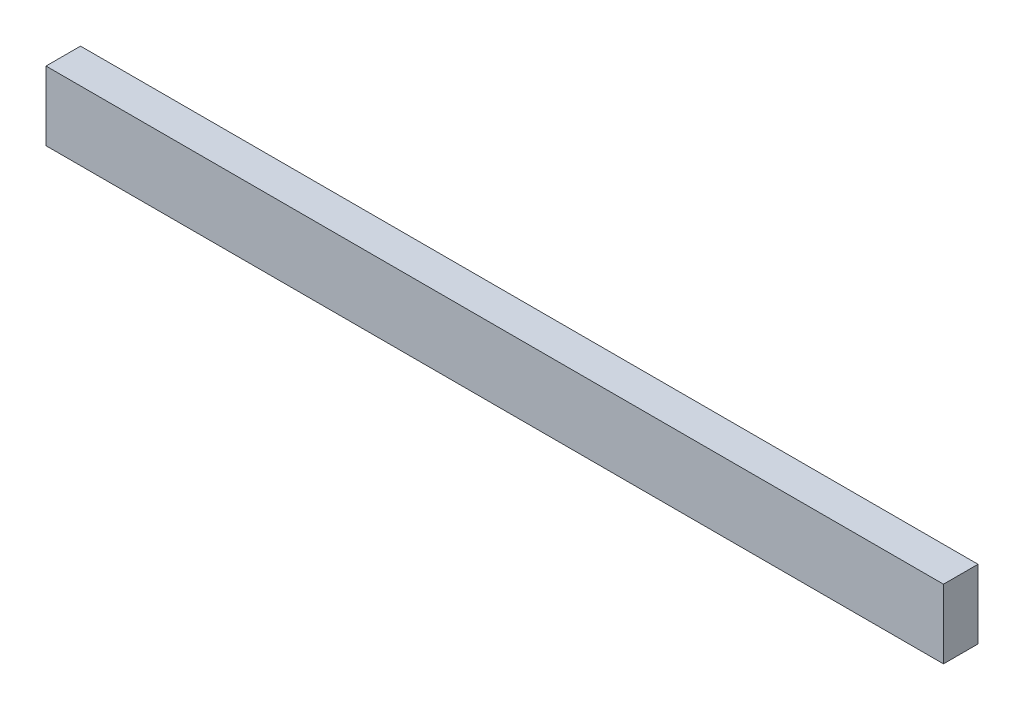
ISO-10303-21;
HEADER;
FILE_DESCRIPTION(('STEP AP214'),'2;1');
FILE_NAME('part.step','',(''),(''),'','','');
FILE_SCHEMA(('AUTOMOTIVE_DESIGN { 1 0 10303 214 1 1 1 1 }'));
ENDSEC;
DATA;
#1=APPLICATION_CONTEXT('core data for automotive mechanical design processes');
#2=APPLICATION_PROTOCOL_DEFINITION('international standard','automotive_design',2000,#1);
#3=PRODUCT_CONTEXT('',#1,'mechanical');
#4=PRODUCT('Part','Part','',(#3));
#5=PRODUCT_RELATED_PRODUCT_CATEGORY('part','',(#4));
#6=PRODUCT_DEFINITION_FORMATION('','',#4);
#7=PRODUCT_DEFINITION_CONTEXT('part definition',#1,'design');
#8=PRODUCT_DEFINITION('design','',#6,#7);
#9=PRODUCT_DEFINITION_SHAPE('','',#8);
#10=(LENGTH_UNIT() NAMED_UNIT(*) SI_UNIT(.MILLI.,.METRE.));
#11=(NAMED_UNIT(*) PLANE_ANGLE_UNIT() SI_UNIT($,.RADIAN.));
#12=(NAMED_UNIT(*) SI_UNIT($,.STERADIAN.) SOLID_ANGLE_UNIT());
#13=UNCERTAINTY_MEASURE_WITH_UNIT(LENGTH_MEASURE(1.E-05),#10,'distance_accuracy_value','');
#14=(GEOMETRIC_REPRESENTATION_CONTEXT(3) GLOBAL_UNCERTAINTY_ASSIGNED_CONTEXT((#13)) GLOBAL_UNIT_ASSIGNED_CONTEXT((#10,
#11,#12)) REPRESENTATION_CONTEXT('',''));
#15=CARTESIAN_POINT('',(0.,0.,0.));
#16=DIRECTION('',(0.,0.,1.));
#17=DIRECTION('',(1.,0.,0.));
#18=AXIS2_PLACEMENT_3D('',#15,#16,#17);
#19=CARTESIAN_POINT('',(130.,-10.,-10.));
#20=DIRECTION('',(1.,0.,0.));
#21=DIRECTION('',(0.,0.,-1.));
#22=AXIS2_PLACEMENT_3D('',#19,#20,#21);
#23=PLANE('',#22);
#24=DIRECTION('',(0.,1.,0.));
#25=VECTOR('',#24,1.);
#26=CARTESIAN_POINT('',(130.,-10.,0.));
#27=LINE('',#26,#25);
#28=CARTESIAN_POINT('',(130.,-10.,0.));
#29=VERTEX_POINT('',#28);
#30=CARTESIAN_POINT('',(130.,10.,0.));
#31=VERTEX_POINT('',#30);
#32=EDGE_CURVE('E97',#29,#31,#27,.T.);
#33=ORIENTED_EDGE('',*,*,#32,.F.);
#34=DIRECTION('',(0.,0.,1.));
#35=VECTOR('',#34,1.);
#36=CARTESIAN_POINT('',(130.,-10.,-10.));
#37=LINE('',#36,#35);
#38=CARTESIAN_POINT('',(130.,-10.,-10.));
#39=VERTEX_POINT('',#38);
#40=EDGE_CURVE('E11',#39,#29,#37,.T.);
#41=ORIENTED_EDGE('',*,*,#40,.F.);
#42=DIRECTION('',(0.,1.,0.));
#43=VECTOR('',#42,1.);
#44=CARTESIAN_POINT('',(130.,-10.,-10.));
#45=LINE('',#44,#43);
#46=CARTESIAN_POINT('',(130.,10.,-10.));
#47=VERTEX_POINT('',#46);
#48=EDGE_CURVE('E91',#39,#47,#45,.T.);
#49=ORIENTED_EDGE('',*,*,#48,.T.);
#50=DIRECTION('',(0.,0.,1.));
#51=VECTOR('',#50,1.);
#52=CARTESIAN_POINT('',(130.,10.,-10.));
#53=LINE('',#52,#51);
#54=EDGE_CURVE('E36',#47,#31,#53,.T.);
#55=ORIENTED_EDGE('',*,*,#54,.T.);
#56=EDGE_LOOP('',(#33,#41,#49,#55));
#57=FACE_BOUND('',#56,.T.);
#58=ADVANCED_FACE('F33',(#57),#23,.T.);
#59=CARTESIAN_POINT('',(-130.,-10.,-10.));
#60=DIRECTION('',(0.,-1.,0.));
#61=DIRECTION('',(0.,0.,-1.));
#62=AXIS2_PLACEMENT_3D('',#59,#60,#61);
#63=PLANE('',#62);
#64=DIRECTION('',(1.,0.,0.));
#65=VECTOR('',#64,1.);
#66=CARTESIAN_POINT('',(-130.,-10.,0.));
#67=LINE('',#66,#65);
#68=CARTESIAN_POINT('',(-130.,-10.,0.));
#69=VERTEX_POINT('',#68);
#70=EDGE_CURVE('E93',#69,#29,#67,.T.);
#71=ORIENTED_EDGE('',*,*,#70,.F.);
#72=DIRECTION('',(0.,0.,1.));
#73=VECTOR('',#72,1.);
#74=CARTESIAN_POINT('',(-130.,-10.,-10.));
#75=LINE('',#74,#73);
#76=CARTESIAN_POINT('',(-130.,-10.,-10.));
#77=VERTEX_POINT('',#76);
#78=EDGE_CURVE('E42',#77,#69,#75,.T.);
#79=ORIENTED_EDGE('',*,*,#78,.F.);
#80=DIRECTION('',(1.,0.,0.));
#81=VECTOR('',#80,1.);
#82=CARTESIAN_POINT('',(-130.,-10.,-10.));
#83=LINE('',#82,#81);
#84=EDGE_CURVE('E88',#77,#39,#83,.T.);
#85=ORIENTED_EDGE('',*,*,#84,.T.);
#86=ORIENTED_EDGE('',*,*,#40,.T.);
#87=EDGE_LOOP('',(#71,#79,#85,#86));
#88=FACE_BOUND('',#87,.T.);
#89=ADVANCED_FACE('F107',(#88),#63,.T.);
#90=CARTESIAN_POINT('',(-130.,-10.,-10.));
#91=DIRECTION('',(-1.,0.,0.));
#92=DIRECTION('',(0.,0.,1.));
#93=AXIS2_PLACEMENT_3D('',#90,#91,#92);
#94=PLANE('',#93);
#95=DIRECTION('',(0.,-1.,0.));
#96=VECTOR('',#95,1.);
#97=CARTESIAN_POINT('',(-130.,-10.,0.));
#98=LINE('',#97,#96);
#99=CARTESIAN_POINT('',(-130.,10.,0.));
#100=VERTEX_POINT('',#99);
#101=EDGE_CURVE('E83',#100,#69,#98,.T.);
#102=ORIENTED_EDGE('',*,*,#101,.F.);
#103=DIRECTION('',(0.,0.,1.));
#104=VECTOR('',#103,1.);
#105=CARTESIAN_POINT('',(-130.,10.,-10.));
#106=LINE('',#105,#104);
#107=CARTESIAN_POINT('',(-130.,10.,-10.));
#108=VERTEX_POINT('',#107);
#109=EDGE_CURVE('E78',#108,#100,#106,.T.);
#110=ORIENTED_EDGE('',*,*,#109,.F.);
#111=DIRECTION('',(0.,-1.,0.));
#112=VECTOR('',#111,1.);
#113=CARTESIAN_POINT('',(-130.,-10.,-10.));
#114=LINE('',#113,#112);
#115=EDGE_CURVE('E81',#108,#77,#114,.T.);
#116=ORIENTED_EDGE('',*,*,#115,.T.);
#117=ORIENTED_EDGE('',*,*,#78,.T.);
#118=EDGE_LOOP('',(#102,#110,#116,#117));
#119=FACE_BOUND('',#118,.T.);
#120=ADVANCED_FACE('F80',(#119),#94,.T.);
#121=CARTESIAN_POINT('',(-130.,10.,-10.));
#122=DIRECTION('',(0.,1.,0.));
#123=DIRECTION('',(0.,0.,1.));
#124=AXIS2_PLACEMENT_3D('',#121,#122,#123);
#125=PLANE('',#124);
#126=DIRECTION('',(-1.,0.,0.));
#127=VECTOR('',#126,1.);
#128=CARTESIAN_POINT('',(-130.,10.,0.));
#129=LINE('',#128,#127);
#130=EDGE_CURVE('E100',#31,#100,#129,.T.);
#131=ORIENTED_EDGE('',*,*,#130,.F.);
#132=ORIENTED_EDGE('',*,*,#54,.F.);
#133=DIRECTION('',(-1.,0.,0.));
#134=VECTOR('',#133,1.);
#135=CARTESIAN_POINT('',(-130.,10.,-10.));
#136=LINE('',#135,#134);
#137=EDGE_CURVE('E87',#47,#108,#136,.T.);
#138=ORIENTED_EDGE('',*,*,#137,.T.);
#139=ORIENTED_EDGE('',*,*,#109,.T.);
#140=EDGE_LOOP('',(#131,#132,#138,#139));
#141=FACE_BOUND('',#140,.T.);
#142=ADVANCED_FACE('F90',(#141),#125,.T.);
#143=CARTESIAN_POINT('',(0.,0.,-10.));
#144=DIRECTION('',(0.,0.,-1.));
#145=DIRECTION('',(-1.,0.,0.));
#146=AXIS2_PLACEMENT_3D('',#143,#144,#145);
#147=PLANE('',#146);
#148=ORIENTED_EDGE('',*,*,#48,.F.);
#149=ORIENTED_EDGE('',*,*,#84,.F.);
#150=ORIENTED_EDGE('',*,*,#115,.F.);
#151=ORIENTED_EDGE('',*,*,#137,.F.);
#152=EDGE_LOOP('',(#148,#149,#150,#151));
#153=FACE_BOUND('',#152,.T.);
#154=ADVANCED_FACE('F86',(#153),#147,.T.);
#155=CARTESIAN_POINT('',(0.,0.,0.));
#156=DIRECTION('',(0.,0.,-1.));
#157=DIRECTION('',(-1.,0.,0.));
#158=AXIS2_PLACEMENT_3D('',#155,#156,#157);
#159=PLANE('',#158);
#160=ORIENTED_EDGE('',*,*,#32,.T.);
#161=ORIENTED_EDGE('',*,*,#130,.T.);
#162=ORIENTED_EDGE('',*,*,#101,.T.);
#163=ORIENTED_EDGE('',*,*,#70,.T.);
#164=EDGE_LOOP('',(#160,#161,#162,#163));
#165=FACE_BOUND('',#164,.T.);
#166=ADVANCED_FACE('F106',(#165),#159,.F.);
#167=CLOSED_SHELL('',(#58,#89,#120,#142,#154,#166));
#168=MANIFOLD_SOLID_BREP('B2',#167);
#169=ADVANCED_BREP_SHAPE_REPRESENTATION('',(#18,#168),#14);
#170=SHAPE_DEFINITION_REPRESENTATION(#9,#169);
ENDSEC;
END-ISO-10303-21;
